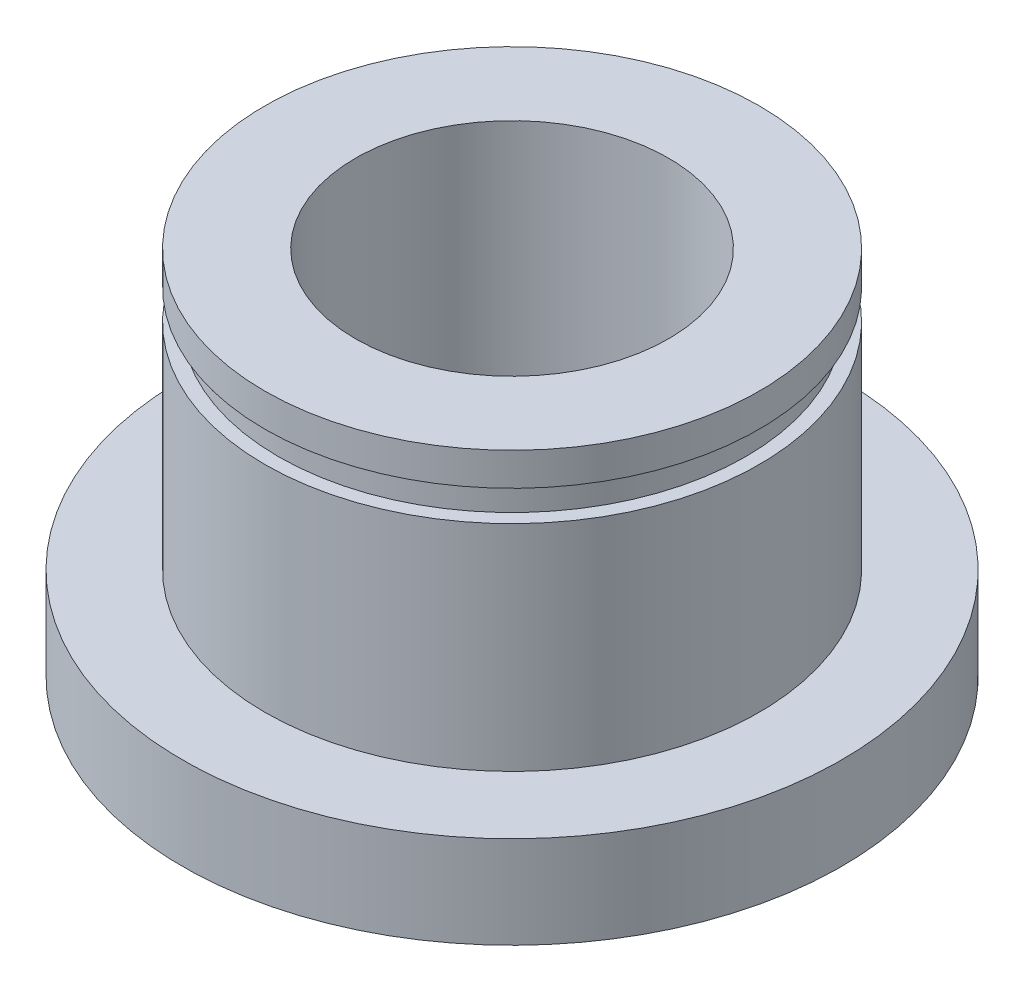
ISO-10303-21;
HEADER;
FILE_DESCRIPTION(('STEP AP214'),'2;1');
FILE_NAME('part.step','',(''),(''),'','','');
FILE_SCHEMA(('AUTOMOTIVE_DESIGN { 1 0 10303 214 1 1 1 1 }'));
ENDSEC;
DATA;
#1=APPLICATION_CONTEXT('core data for automotive mechanical design processes');
#2=APPLICATION_PROTOCOL_DEFINITION('international standard','automotive_design',2000,#1);
#3=PRODUCT_CONTEXT('',#1,'mechanical');
#4=PRODUCT('Part','Part','',(#3));
#5=PRODUCT_RELATED_PRODUCT_CATEGORY('part','',(#4));
#6=PRODUCT_DEFINITION_FORMATION('','',#4);
#7=PRODUCT_DEFINITION_CONTEXT('part definition',#1,'design');
#8=PRODUCT_DEFINITION('design','',#6,#7);
#9=PRODUCT_DEFINITION_SHAPE('','',#8);
#10=(LENGTH_UNIT() NAMED_UNIT(*) SI_UNIT(.MILLI.,.METRE.));
#11=(NAMED_UNIT(*) PLANE_ANGLE_UNIT() SI_UNIT($,.RADIAN.));
#12=(NAMED_UNIT(*) SI_UNIT($,.STERADIAN.) SOLID_ANGLE_UNIT());
#13=UNCERTAINTY_MEASURE_WITH_UNIT(LENGTH_MEASURE(1.E-05),#10,'distance_accuracy_value','');
#14=(GEOMETRIC_REPRESENTATION_CONTEXT(3) GLOBAL_UNCERTAINTY_ASSIGNED_CONTEXT((#13)) GLOBAL_UNIT_ASSIGNED_CONTEXT((#10,
#11,#12)) REPRESENTATION_CONTEXT('',''));
#15=CARTESIAN_POINT('',(0.,0.,0.));
#16=DIRECTION('',(0.,0.,1.));
#17=DIRECTION('',(1.,0.,0.));
#18=AXIS2_PLACEMENT_3D('',#15,#16,#17);
#19=CARTESIAN_POINT('',(0.,-4.460875,0.));
#20=DIRECTION('',(0.,1.,0.));
#21=DIRECTION('',(0.,0.,1.));
#22=AXIS2_PLACEMENT_3D('',#19,#20,#21);
#23=PLANE('',#22);
#24=CARTESIAN_POINT('',(0.,-4.460875,0.));
#25=DIRECTION('',(0.,1.,0.));
#26=DIRECTION('',(0.,0.,1.));
#27=AXIS2_PLACEMENT_3D('',#24,#25,#26);
#28=CIRCLE('',#27,4.564126);
#29=CARTESIAN_POINT('',(0.,-4.460875,4.564126));
#30=VERTEX_POINT('',#29);
#31=EDGE_CURVE('E42',#30,#30,#28,.T.);
#32=ORIENTED_EDGE('',*,*,#31,.T.);
#33=EDGE_LOOP('',(#32));
#34=FACE_BOUND('',#33,.T.);
#35=CARTESIAN_POINT('',(0.,-4.460875,0.));
#36=DIRECTION('',(0.,-1.,0.));
#37=DIRECTION('',(0.,0.,-1.));
#38=AXIS2_PLACEMENT_3D('',#35,#36,#37);
#39=CIRCLE('',#38,7.9375);
#40=CARTESIAN_POINT('',(0.,-4.460875,-7.9375));
#41=VERTEX_POINT('',#40);
#42=EDGE_CURVE('E46',#41,#41,#39,.T.);
#43=ORIENTED_EDGE('',*,*,#42,.T.);
#44=EDGE_LOOP('',(#43));
#45=FACE_BOUND('',#44,.T.);
#46=ADVANCED_FACE('F35',(#34,#45),#23,.F.);
#47=CARTESIAN_POINT('',(0.,0.,0.));
#48=DIRECTION('',(0.,-1.,0.));
#49=DIRECTION('',(0.,0.,-1.));
#50=AXIS2_PLACEMENT_3D('',#47,#48,#49);
#51=CYLINDRICAL_SURFACE('',#50,7.9375);
#52=ORIENTED_EDGE('',*,*,#42,.F.);
#53=EDGE_LOOP('',(#52));
#54=FACE_BOUND('',#53,.T.);
#55=CARTESIAN_POINT('',(0.,-2.238375,0.));
#56=DIRECTION('',(0.,-1.,0.));
#57=DIRECTION('',(0.,0.,-1.));
#58=AXIS2_PLACEMENT_3D('',#55,#56,#57);
#59=CIRCLE('',#58,7.9375);
#60=CARTESIAN_POINT('',(0.,-2.238375,-7.9375));
#61=VERTEX_POINT('',#60);
#62=EDGE_CURVE('E50',#61,#61,#59,.T.);
#63=ORIENTED_EDGE('',*,*,#62,.T.);
#64=EDGE_LOOP('',(#63));
#65=FACE_BOUND('',#64,.T.);
#66=ADVANCED_FACE('F98',(#54,#65),#51,.T.);
#67=CARTESIAN_POINT('',(0.,-2.238375,7.9375));
#68=DIRECTION('',(0.,-1.,0.));
#69=DIRECTION('',(0.,0.,-1.));
#70=AXIS2_PLACEMENT_3D('',#67,#68,#69);
#71=PLANE('',#70);
#72=ORIENTED_EDGE('',*,*,#62,.F.);
#73=EDGE_LOOP('',(#72));
#74=FACE_BOUND('',#73,.T.);
#75=CARTESIAN_POINT('',(0.,-2.238375,0.));
#76=DIRECTION('',(0.,-1.,0.));
#77=DIRECTION('',(0.,0.,-1.));
#78=AXIS2_PLACEMENT_3D('',#75,#76,#77);
#79=CIRCLE('',#78,5.953125);
#80=CARTESIAN_POINT('',(0.,-2.238375,-5.953125));
#81=VERTEX_POINT('',#80);
#82=EDGE_CURVE('E55',#81,#81,#79,.T.);
#83=ORIENTED_EDGE('',*,*,#82,.T.);
#84=EDGE_LOOP('',(#83));
#85=FACE_BOUND('',#84,.T.);
#86=ADVANCED_FACE('F102',(#74,#85),#71,.F.);
#87=CARTESIAN_POINT('',(0.,0.,0.));
#88=DIRECTION('',(0.,-1.,0.));
#89=DIRECTION('',(0.,0.,-1.));
#90=AXIS2_PLACEMENT_3D('',#87,#88,#89);
#91=CYLINDRICAL_SURFACE('',#90,5.953125);
#92=ORIENTED_EDGE('',*,*,#82,.F.);
#93=EDGE_LOOP('',(#92));
#94=FACE_BOUND('',#93,.T.);
#95=CARTESIAN_POINT('',(0.,2.930525,0.));
#96=DIRECTION('',(0.,-1.,0.));
#97=DIRECTION('',(0.,0.,-1.));
#98=AXIS2_PLACEMENT_3D('',#95,#96,#97);
#99=CIRCLE('',#98,5.953125);
#100=CARTESIAN_POINT('',(0.,2.930525,-5.953125));
#101=VERTEX_POINT('',#100);
#102=EDGE_CURVE('E58',#101,#101,#99,.T.);
#103=ORIENTED_EDGE('',*,*,#102,.T.);
#104=EDGE_LOOP('',(#103));
#105=FACE_BOUND('',#104,.T.);
#106=ADVANCED_FACE('F109',(#94,#105),#91,.T.);
#107=CARTESIAN_POINT('',(0.,2.930525,5.953125));
#108=DIRECTION('',(0.,-1.,0.));
#109=DIRECTION('',(0.,0.,-1.));
#110=AXIS2_PLACEMENT_3D('',#107,#108,#109);
#111=PLANE('',#110);
#112=ORIENTED_EDGE('',*,*,#102,.F.);
#113=EDGE_LOOP('',(#112));
#114=FACE_BOUND('',#113,.T.);
#115=CARTESIAN_POINT('',(0.,2.930525,0.));
#116=DIRECTION('',(0.,-1.,0.));
#117=DIRECTION('',(0.,0.,-1.));
#118=AXIS2_PLACEMENT_3D('',#115,#116,#117);
#119=CIRCLE('',#118,5.6261);
#120=CARTESIAN_POINT('',(0.,2.930525,-5.6261));
#121=VERTEX_POINT('',#120);
#122=EDGE_CURVE('E61',#121,#121,#119,.T.);
#123=ORIENTED_EDGE('',*,*,#122,.T.);
#124=EDGE_LOOP('',(#123));
#125=FACE_BOUND('',#124,.T.);
#126=ADVANCED_FACE('F113',(#114,#125),#111,.F.);
#127=CARTESIAN_POINT('',(0.,0.,0.));
#128=DIRECTION('',(0.,-1.,0.));
#129=DIRECTION('',(0.,0.,-1.));
#130=AXIS2_PLACEMENT_3D('',#127,#128,#129);
#131=CYLINDRICAL_SURFACE('',#130,5.6261);
#132=ORIENTED_EDGE('',*,*,#122,.F.);
#133=EDGE_LOOP('',(#132));
#134=FACE_BOUND('',#133,.T.);
#135=CARTESIAN_POINT('',(0.,3.667125,0.));
#136=DIRECTION('',(0.,-1.,0.));
#137=DIRECTION('',(0.,0.,-1.));
#138=AXIS2_PLACEMENT_3D('',#135,#136,#137);
#139=CIRCLE('',#138,5.6261);
#140=CARTESIAN_POINT('',(0.,3.667125,-5.6261));
#141=VERTEX_POINT('',#140);
#142=EDGE_CURVE('E64',#141,#141,#139,.T.);
#143=ORIENTED_EDGE('',*,*,#142,.T.);
#144=EDGE_LOOP('',(#143));
#145=FACE_BOUND('',#144,.T.);
#146=ADVANCED_FACE('F93',(#134,#145),#131,.T.);
#147=CARTESIAN_POINT('',(0.,3.667125,5.6261));
#148=DIRECTION('',(0.,1.,0.));
#149=DIRECTION('',(0.,0.,1.));
#150=AXIS2_PLACEMENT_3D('',#147,#148,#149);
#151=PLANE('',#150);
#152=ORIENTED_EDGE('',*,*,#142,.F.);
#153=EDGE_LOOP('',(#152));
#154=FACE_BOUND('',#153,.T.);
#155=CARTESIAN_POINT('',(0.,3.667125,0.));
#156=DIRECTION('',(0.,-1.,0.));
#157=DIRECTION('',(0.,0.,-1.));
#158=AXIS2_PLACEMENT_3D('',#155,#156,#157);
#159=CIRCLE('',#158,5.953125);
#160=CARTESIAN_POINT('',(0.,3.667125,-5.953125));
#161=VERTEX_POINT('',#160);
#162=EDGE_CURVE('E67',#161,#161,#159,.T.);
#163=ORIENTED_EDGE('',*,*,#162,.T.);
#164=EDGE_LOOP('',(#163));
#165=FACE_BOUND('',#164,.T.);
#166=ADVANCED_FACE('F87',(#154,#165),#151,.F.);
#167=CARTESIAN_POINT('',(0.,0.,0.));
#168=DIRECTION('',(0.,-1.,0.));
#169=DIRECTION('',(0.,0.,-1.));
#170=AXIS2_PLACEMENT_3D('',#167,#168,#169);
#171=CYLINDRICAL_SURFACE('',#170,5.953125);
#172=ORIENTED_EDGE('',*,*,#162,.F.);
#173=EDGE_LOOP('',(#172));
#174=FACE_BOUND('',#173,.T.);
#175=CARTESIAN_POINT('',(0.,4.460875,0.));
#176=DIRECTION('',(0.,-1.,0.));
#177=DIRECTION('',(0.,0.,-1.));
#178=AXIS2_PLACEMENT_3D('',#175,#176,#177);
#179=CIRCLE('',#178,5.953125);
#180=CARTESIAN_POINT('',(0.,4.460875,-5.953125));
#181=VERTEX_POINT('',#180);
#182=EDGE_CURVE('E70',#181,#181,#179,.T.);
#183=ORIENTED_EDGE('',*,*,#182,.T.);
#184=EDGE_LOOP('',(#183));
#185=FACE_BOUND('',#184,.T.);
#186=ADVANCED_FACE('F82',(#174,#185),#171,.T.);
#187=CARTESIAN_POINT('',(0.,4.460875,5.953125));
#188=DIRECTION('',(0.,-1.,0.));
#189=DIRECTION('',(0.,0.,-1.));
#190=AXIS2_PLACEMENT_3D('',#187,#188,#189);
#191=PLANE('',#190);
#192=CARTESIAN_POINT('',(0.,4.460875,0.));
#193=DIRECTION('',(0.,1.,0.));
#194=DIRECTION('',(0.,0.,1.));
#195=AXIS2_PLACEMENT_3D('',#192,#193,#194);
#196=CIRCLE('',#195,3.77037599999999);
#197=CARTESIAN_POINT('',(0.,4.460875,3.77037599999999));
#198=VERTEX_POINT('',#197);
#199=EDGE_CURVE('E73',#198,#198,#196,.T.);
#200=ORIENTED_EDGE('',*,*,#199,.F.);
#201=EDGE_LOOP('',(#200));
#202=FACE_BOUND('',#201,.T.);
#203=ORIENTED_EDGE('',*,*,#182,.F.);
#204=EDGE_LOOP('',(#203));
#205=FACE_BOUND('',#204,.T.);
#206=ADVANCED_FACE('F79',(#202,#205),#191,.F.);
#207=CARTESIAN_POINT('',(0.,4.460875,0.));
#208=DIRECTION('',(0.,1.,0.));
#209=DIRECTION('',(0.,0.,1.));
#210=AXIS2_PLACEMENT_3D('',#207,#208,#209);
#211=CYLINDRICAL_SURFACE('',#210,3.77037599999999);
#212=CARTESIAN_POINT('',(0.,-3.66712499999999,0.));
#213=DIRECTION('',(0.,1.,0.));
#214=DIRECTION('',(0.,0.,1.));
#215=AXIS2_PLACEMENT_3D('',#212,#213,#214);
#216=CIRCLE('',#215,3.77037599999999);
#217=CARTESIAN_POINT('',(0.,-3.66712499999999,3.77037599999999));
#218=VERTEX_POINT('',#217);
#219=EDGE_CURVE('E10',#218,#218,#216,.F.);
#220=ORIENTED_EDGE('',*,*,#219,.T.);
#221=EDGE_LOOP('',(#220));
#222=FACE_BOUND('',#221,.T.);
#223=ORIENTED_EDGE('',*,*,#199,.T.);
#224=EDGE_LOOP('',(#223));
#225=FACE_BOUND('',#224,.T.);
#226=ADVANCED_FACE('F77',(#222,#225),#211,.F.);
#227=CARTESIAN_POINT('',(0.,-4.460875,0.));
#228=DIRECTION('',(0.,-1.,0.));
#229=DIRECTION('',(0.,0.,-1.));
#230=AXIS2_PLACEMENT_3D('',#227,#228,#229);
#231=CONICAL_SURFACE('',#230,4.564126,0.785398163397447);
#232=ORIENTED_EDGE('',*,*,#219,.F.);
#233=EDGE_LOOP('',(#232));
#234=FACE_BOUND('',#233,.T.);
#235=ORIENTED_EDGE('',*,*,#31,.F.);
#236=EDGE_LOOP('',(#235));
#237=FACE_BOUND('',#236,.T.);
#238=ADVANCED_FACE('F37',(#234,#237),#231,.F.);
#239=CLOSED_SHELL('',(#46,#66,#86,#106,#126,#146,#166,#186,#206,#226,#238));
#240=MANIFOLD_SOLID_BREP('B2',#239);
#241=ADVANCED_BREP_SHAPE_REPRESENTATION('',(#18,#240),#14);
#242=SHAPE_DEFINITION_REPRESENTATION(#9,#241);
ENDSEC;
END-ISO-10303-21;
